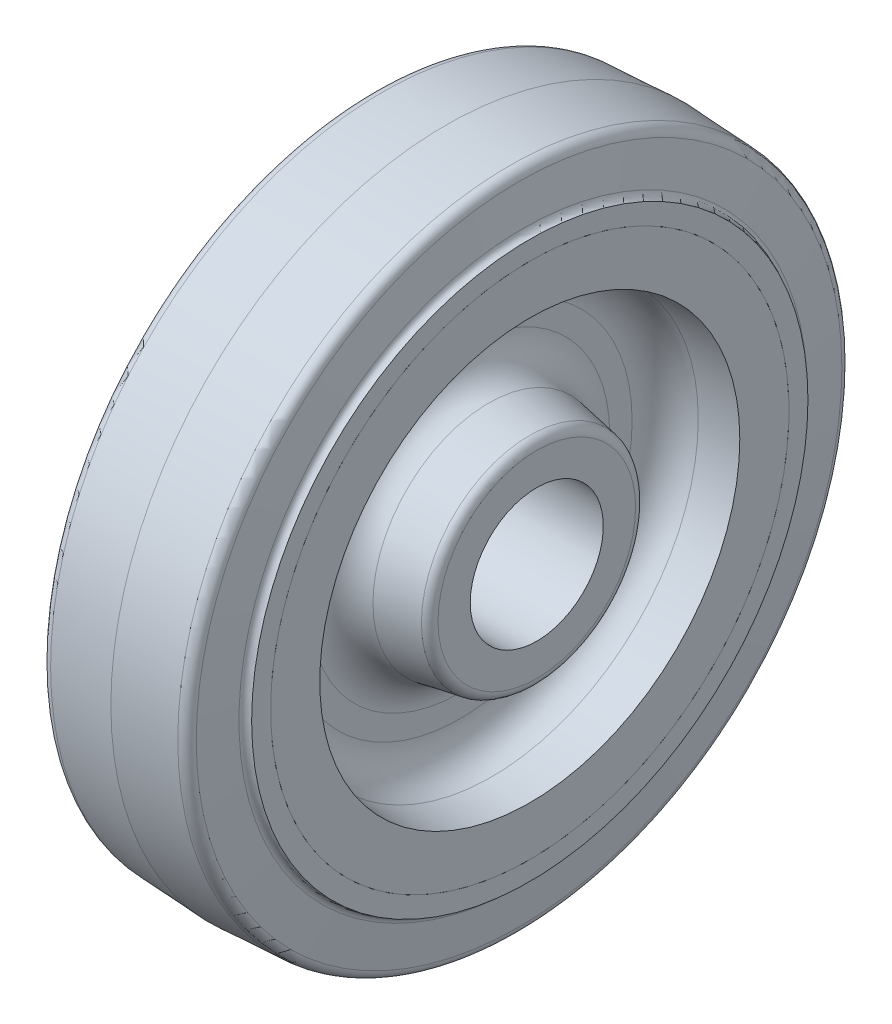
ISO-10303-21;
HEADER;
FILE_DESCRIPTION(('STEP AP214'),'2;1');
FILE_NAME('part.step','',(''),(''),'','','');
FILE_SCHEMA(('AUTOMOTIVE_DESIGN { 1 0 10303 214 1 1 1 1 }'));
ENDSEC;
DATA;
#1=APPLICATION_CONTEXT('core data for automotive mechanical design processes');
#2=APPLICATION_PROTOCOL_DEFINITION('international standard','automotive_design',2000,#1);
#3=PRODUCT_CONTEXT('',#1,'mechanical');
#4=PRODUCT('Part','Part','',(#3));
#5=PRODUCT_RELATED_PRODUCT_CATEGORY('part','',(#4));
#6=PRODUCT_DEFINITION_FORMATION('','',#4);
#7=PRODUCT_DEFINITION_CONTEXT('part definition',#1,'design');
#8=PRODUCT_DEFINITION('design','',#6,#7);
#9=PRODUCT_DEFINITION_SHAPE('','',#8);
#10=(LENGTH_UNIT() NAMED_UNIT(*) SI_UNIT(.MILLI.,.METRE.));
#11=(NAMED_UNIT(*) PLANE_ANGLE_UNIT() SI_UNIT($,.RADIAN.));
#12=(NAMED_UNIT(*) SI_UNIT($,.STERADIAN.) SOLID_ANGLE_UNIT());
#13=UNCERTAINTY_MEASURE_WITH_UNIT(LENGTH_MEASURE(1.E-05),#10,'distance_accuracy_value','');
#14=(GEOMETRIC_REPRESENTATION_CONTEXT(3) GLOBAL_UNCERTAINTY_ASSIGNED_CONTEXT((#13)) GLOBAL_UNIT_ASSIGNED_CONTEXT((#10,
#11,#12)) REPRESENTATION_CONTEXT('',''));
#15=CARTESIAN_POINT('',(0.,0.,0.));
#16=DIRECTION('',(0.,0.,1.));
#17=DIRECTION('',(1.,0.,0.));
#18=AXIS2_PLACEMENT_3D('',#15,#16,#17);
#19=CARTESIAN_POINT('',(0.,0.,0.));
#20=DIRECTION('',(-1.,0.,0.));
#21=DIRECTION('',(0.,0.,1.));
#22=AXIS2_PLACEMENT_3D('',#19,#20,#21);
#23=CONICAL_SURFACE('',#22,76.2,0.0523598775598228);
#24=CARTESIAN_POINT('',(14.4568836007253,0.,0.));
#25=DIRECTION('',(1.,0.,0.));
#26=DIRECTION('',(0.,0.,-1.));
#27=AXIS2_PLACEMENT_3D('',#24,#25,#26);
#28=CIRCLE('',#27,75.4423468351327);
#29=CARTESIAN_POINT('',(14.4568836007253,0.,-75.4423468351327));
#30=VERTEX_POINT('',#29);
#31=EDGE_CURVE('P0_E84',#30,#30,#28,.T.);
#32=ORIENTED_EDGE('',*,*,#31,.F.);
#33=EDGE_LOOP('',(#32));
#34=FACE_BOUND('',#33,.T.);
#35=CARTESIAN_POINT('',(0.,0.,0.));
#36=DIRECTION('',(1.,0.,0.));
#37=DIRECTION('',(0.,0.,-1.));
#38=AXIS2_PLACEMENT_3D('',#35,#36,#37);
#39=CIRCLE('',#38,76.2);
#40=CARTESIAN_POINT('',(0.,0.,-76.2));
#41=VERTEX_POINT('',#40);
#42=EDGE_CURVE('P0_E29',#41,#41,#39,.F.);
#43=ORIENTED_EDGE('',*,*,#42,.F.);
#44=EDGE_LOOP('',(#43));
#45=FACE_BOUND('',#44,.T.);
#46=ADVANCED_FACE('P0_F14',(#34,#45),#23,.T.);
#47=CARTESIAN_POINT('',(0.,0.,0.));
#48=DIRECTION('',(1.,0.,0.));
#49=DIRECTION('',(0.,0.,-1.));
#50=AXIS2_PLACEMENT_3D('',#47,#48,#49);
#51=CONICAL_SURFACE('',#50,76.2,0.0523598775598227);
#52=CARTESIAN_POINT('',(-14.4568836007253,0.,0.));
#53=DIRECTION('',(1.,0.,0.));
#54=DIRECTION('',(0.,0.,-1.));
#55=AXIS2_PLACEMENT_3D('',#52,#53,#54);
#56=CIRCLE('',#55,75.4423468351327);
#57=CARTESIAN_POINT('',(-14.4568836007253,0.,-75.4423468351327));
#58=VERTEX_POINT('',#57);
#59=EDGE_CURVE('P0_E82',#58,#58,#56,.F.);
#60=ORIENTED_EDGE('',*,*,#59,.F.);
#61=EDGE_LOOP('',(#60));
#62=FACE_BOUND('',#61,.T.);
#63=ORIENTED_EDGE('',*,*,#42,.T.);
#64=EDGE_LOOP('',(#63));
#65=FACE_BOUND('',#64,.T.);
#66=ADVANCED_FACE('P0_F75',(#62,#65),#51,.T.);
#67=CARTESIAN_POINT('',(14.3372436047539,0.,0.));
#68=DIRECTION('',(1.,0.,0.));
#69=DIRECTION('',(0.,0.,-1.));
#70=AXIS2_PLACEMENT_3D('',#67,#68,#69);
#71=TOROIDAL_SURFACE('',#70,73.1594797186837,2.286);
#72=ORIENTED_EDGE('',*,*,#31,.T.);
#73=EDGE_LOOP('',(#72));
#74=FACE_BOUND('',#73,.T.);
#75=CARTESIAN_POINT('',(16.6107206575658,0.,0.));
#76=DIRECTION('',(-1.,0.,0.));
#77=DIRECTION('',(0.,0.,1.));
#78=AXIS2_PLACEMENT_3D('',#75,#76,#77);
#79=CIRCLE('',#78,73.3984317857136);
#80=CARTESIAN_POINT('',(16.6107206575658,0.,73.3984317857136));
#81=VERTEX_POINT('',#80);
#82=EDGE_CURVE('P0_E79',#81,#81,#79,.F.);
#83=ORIENTED_EDGE('',*,*,#82,.F.);
#84=EDGE_LOOP('',(#83));
#85=FACE_BOUND('',#84,.T.);
#86=ADVANCED_FACE('P0_F71',(#74,#85),#71,.T.);
#87=CARTESIAN_POINT('',(-14.3372436047539,0.,0.));
#88=DIRECTION('',(1.,0.,0.));
#89=DIRECTION('',(0.,0.,-1.));
#90=AXIS2_PLACEMENT_3D('',#87,#88,#89);
#91=TOROIDAL_SURFACE('',#90,73.1594797186837,2.286);
#92=CARTESIAN_POINT('',(-16.6107206575658,0.,0.));
#93=DIRECTION('',(1.,0.,0.));
#94=DIRECTION('',(0.,0.,-1.));
#95=AXIS2_PLACEMENT_3D('',#92,#93,#94);
#96=CIRCLE('',#95,73.3984317857136);
#97=CARTESIAN_POINT('',(-16.6107206575658,0.,-73.3984317857136));
#98=VERTEX_POINT('',#97);
#99=EDGE_CURVE('P0_E56',#98,#98,#96,.F.);
#100=ORIENTED_EDGE('',*,*,#99,.F.);
#101=EDGE_LOOP('',(#100));
#102=FACE_BOUND('',#101,.T.);
#103=ORIENTED_EDGE('',*,*,#59,.T.);
#104=EDGE_LOOP('',(#103));
#105=FACE_BOUND('',#104,.T.);
#106=ADVANCED_FACE('P0_F66',(#102,#105),#91,.T.);
#107=CARTESIAN_POINT('',(16.6107206575658,0.,0.));
#108=DIRECTION('',(-1.,0.,0.));
#109=DIRECTION('',(0.,0.,1.));
#110=AXIS2_PLACEMENT_3D('',#107,#108,#109);
#111=CONICAL_SURFACE('',#110,73.3984317857136,1.46607657167524);
#112=CARTESIAN_POINT('',(17.5343486314588,0.,0.));
#113=DIRECTION('',(1.,0.,0.));
#114=DIRECTION('',(0.,0.,-1.));
#115=AXIS2_PLACEMENT_3D('',#112,#113,#114);
#116=CIRCLE('',#115,64.6106986219801);
#117=CARTESIAN_POINT('',(17.5343486314588,0.,-64.6106986219801));
#118=VERTEX_POINT('',#117);
#119=EDGE_CURVE('P0_E51',#118,#118,#116,.F.);
#120=ORIENTED_EDGE('',*,*,#119,.T.);
#121=EDGE_LOOP('',(#120));
#122=FACE_BOUND('',#121,.T.);
#123=ORIENTED_EDGE('',*,*,#82,.T.);
#124=EDGE_LOOP('',(#123));
#125=FACE_BOUND('',#124,.T.);
#126=ADVANCED_FACE('P0_F70',(#122,#125),#111,.T.);
#127=CARTESIAN_POINT('',(-16.6107206575658,0.,0.));
#128=DIRECTION('',(1.,0.,0.));
#129=DIRECTION('',(0.,0.,-1.));
#130=AXIS2_PLACEMENT_3D('',#127,#128,#129);
#131=CONICAL_SURFACE('',#130,73.3984317857136,1.46607657167524);
#132=CARTESIAN_POINT('',(-17.5343486314587,0.,0.));
#133=DIRECTION('',(1.,0.,0.));
#134=DIRECTION('',(0.,0.,-1.));
#135=AXIS2_PLACEMENT_3D('',#132,#133,#134);
#136=CIRCLE('',#135,64.6106986219801);
#137=CARTESIAN_POINT('',(-17.5343486314587,0.,-64.6106986219801));
#138=VERTEX_POINT('',#137);
#139=EDGE_CURVE('P0_E47',#138,#138,#136,.T.);
#140=ORIENTED_EDGE('',*,*,#139,.T.);
#141=EDGE_LOOP('',(#140));
#142=FACE_BOUND('',#141,.T.);
#143=ORIENTED_EDGE('',*,*,#99,.T.);
#144=EDGE_LOOP('',(#143));
#145=FACE_BOUND('',#144,.T.);
#146=ADVANCED_FACE('P0_F137',(#142,#145),#131,.T.);
#147=CARTESIAN_POINT('',(19.05,0.,0.));
#148=DIRECTION('',(1.,0.,0.));
#149=DIRECTION('',(0.,0.,-1.));
#150=AXIS2_PLACEMENT_3D('',#147,#148,#149);
#151=TOROIDAL_SURFACE('',#150,64.77,1.524);
#152=ORIENTED_EDGE('',*,*,#119,.F.);
#153=EDGE_LOOP('',(#152));
#154=FACE_BOUND('',#153,.T.);
#155=CARTESIAN_POINT('',(19.05,0.,0.));
#156=DIRECTION('',(1.,0.,0.));
#157=DIRECTION('',(0.,0.,-1.));
#158=AXIS2_PLACEMENT_3D('',#155,#156,#157);
#159=CIRCLE('',#158,63.246);
#160=CARTESIAN_POINT('',(19.05,0.,-63.246));
#161=VERTEX_POINT('',#160);
#162=EDGE_CURVE('P0_E17',#161,#161,#159,.T.);
#163=ORIENTED_EDGE('',*,*,#162,.F.);
#164=EDGE_LOOP('',(#163));
#165=FACE_BOUND('',#164,.T.);
#166=ADVANCED_FACE('P0_F133',(#154,#165),#151,.F.);
#167=CARTESIAN_POINT('',(-19.05,0.,0.));
#168=DIRECTION('',(1.,0.,0.));
#169=DIRECTION('',(0.,0.,-1.));
#170=AXIS2_PLACEMENT_3D('',#167,#168,#169);
#171=TOROIDAL_SURFACE('',#170,64.77,1.524);
#172=CARTESIAN_POINT('',(-19.05,0.,0.));
#173=DIRECTION('',(1.,0.,0.));
#174=DIRECTION('',(0.,0.,-1.));
#175=AXIS2_PLACEMENT_3D('',#172,#173,#174);
#176=CIRCLE('',#175,63.246);
#177=CARTESIAN_POINT('',(-19.05,0.,-63.246));
#178=VERTEX_POINT('',#177);
#179=EDGE_CURVE('P0_E42',#178,#178,#176,.F.);
#180=ORIENTED_EDGE('',*,*,#179,.F.);
#181=EDGE_LOOP('',(#180));
#182=FACE_BOUND('',#181,.T.);
#183=ORIENTED_EDGE('',*,*,#139,.F.);
#184=EDGE_LOOP('',(#183));
#185=FACE_BOUND('',#184,.T.);
#186=ADVANCED_FACE('P0_F129',(#182,#185),#171,.F.);
#187=CARTESIAN_POINT('',(19.05,63.246,0.));
#188=DIRECTION('',(1.,0.,0.));
#189=DIRECTION('',(0.,0.,-1.));
#190=AXIS2_PLACEMENT_3D('',#187,#188,#189);
#191=PLANE('',#190);
#192=CARTESIAN_POINT('',(19.05,0.,0.));
#193=DIRECTION('',(1.,0.,0.));
#194=DIRECTION('',(0.,0.,-1.));
#195=AXIS2_PLACEMENT_3D('',#192,#193,#194);
#196=CIRCLE('',#195,58.928);
#197=CARTESIAN_POINT('',(19.05,0.,-58.928));
#198=VERTEX_POINT('',#197);
#199=EDGE_CURVE('P0_E40',#198,#198,#196,.F.);
#200=ORIENTED_EDGE('',*,*,#199,.T.);
#201=EDGE_LOOP('',(#200));
#202=FACE_BOUND('',#201,.T.);
#203=ORIENTED_EDGE('',*,*,#162,.T.);
#204=EDGE_LOOP('',(#203));
#205=FACE_BOUND('',#204,.T.);
#206=ADVANCED_FACE('P0_F126',(#202,#205),#191,.T.);
#207=CARTESIAN_POINT('',(-19.05,58.928,0.));
#208=DIRECTION('',(-1.,0.,0.));
#209=DIRECTION('',(0.,0.,1.));
#210=AXIS2_PLACEMENT_3D('',#207,#208,#209);
#211=PLANE('',#210);
#212=ORIENTED_EDGE('',*,*,#179,.T.);
#213=EDGE_LOOP('',(#212));
#214=FACE_BOUND('',#213,.T.);
#215=CARTESIAN_POINT('',(-19.05,0.,0.));
#216=DIRECTION('',(1.,0.,0.));
#217=DIRECTION('',(0.,0.,-1.));
#218=AXIS2_PLACEMENT_3D('',#215,#216,#217);
#219=CIRCLE('',#218,58.928);
#220=CARTESIAN_POINT('',(-19.05,0.,-58.928));
#221=VERTEX_POINT('',#220);
#222=EDGE_CURVE('P0_E37',#221,#221,#219,.T.);
#223=ORIENTED_EDGE('',*,*,#222,.T.);
#224=EDGE_LOOP('',(#223));
#225=FACE_BOUND('',#224,.T.);
#226=ADVANCED_FACE('P0_F122',(#214,#225),#211,.T.);
#227=CARTESIAN_POINT('',(0.,0.,0.));
#228=DIRECTION('',(1.,0.,0.));
#229=DIRECTION('',(0.,0.,-1.));
#230=AXIS2_PLACEMENT_3D('',#227,#228,#229);
#231=CYLINDRICAL_SURFACE('',#230,58.928);
#232=ORIENTED_EDGE('',*,*,#199,.F.);
#233=EDGE_LOOP('',(#232));
#234=FACE_BOUND('',#233,.T.);
#235=CARTESIAN_POINT('',(12.7,0.,0.));
#236=DIRECTION('',(1.,0.,0.));
#237=DIRECTION('',(0.,0.,-1.));
#238=AXIS2_PLACEMENT_3D('',#235,#236,#237);
#239=CIRCLE('',#238,58.928);
#240=CARTESIAN_POINT('',(12.7,0.,-58.928));
#241=VERTEX_POINT('',#240);
#242=EDGE_CURVE('P0_E34',#241,#241,#239,.T.);
#243=ORIENTED_EDGE('',*,*,#242,.F.);
#244=EDGE_LOOP('',(#243));
#245=FACE_BOUND('',#244,.T.);
#246=ADVANCED_FACE('P0_F118',(#234,#245),#231,.F.);
#247=CARTESIAN_POINT('',(0.,0.,0.));
#248=DIRECTION('',(1.,0.,0.));
#249=DIRECTION('',(0.,0.,-1.));
#250=AXIS2_PLACEMENT_3D('',#247,#248,#249);
#251=CYLINDRICAL_SURFACE('',#250,58.928);
#252=CARTESIAN_POINT('',(-12.7,0.,0.));
#253=DIRECTION('',(1.,0.,0.));
#254=DIRECTION('',(0.,0.,-1.));
#255=AXIS2_PLACEMENT_3D('',#252,#253,#254);
#256=CIRCLE('',#255,58.928);
#257=CARTESIAN_POINT('',(-12.7,0.,-58.928));
#258=VERTEX_POINT('',#257);
#259=EDGE_CURVE('P0_E26',#258,#258,#256,.F.);
#260=ORIENTED_EDGE('',*,*,#259,.F.);
#261=EDGE_LOOP('',(#260));
#262=FACE_BOUND('',#261,.T.);
#263=ORIENTED_EDGE('',*,*,#222,.F.);
#264=EDGE_LOOP('',(#263));
#265=FACE_BOUND('',#264,.T.);
#266=ADVANCED_FACE('P0_F114',(#262,#265),#251,.F.);
#267=CARTESIAN_POINT('',(12.7,58.928,0.));
#268=DIRECTION('',(-1.,0.,0.));
#269=DIRECTION('',(0.,0.,1.));
#270=AXIS2_PLACEMENT_3D('',#267,#268,#269);
#271=PLANE('',#270);
#272=CARTESIAN_POINT('',(12.7,0.,0.));
#273=DIRECTION('',(1.,0.,0.));
#274=DIRECTION('',(0.,0.,-1.));
#275=AXIS2_PLACEMENT_3D('',#272,#273,#274);
#276=CIRCLE('',#275,66.548);
#277=CARTESIAN_POINT('',(12.7,0.,-66.548));
#278=VERTEX_POINT('',#277);
#279=EDGE_CURVE('P0_E21',#278,#278,#276,.F.);
#280=ORIENTED_EDGE('',*,*,#279,.T.);
#281=EDGE_LOOP('',(#280));
#282=FACE_BOUND('',#281,.T.);
#283=ORIENTED_EDGE('',*,*,#242,.T.);
#284=EDGE_LOOP('',(#283));
#285=FACE_BOUND('',#284,.T.);
#286=ADVANCED_FACE('P0_F106',(#282,#285),#271,.T.);
#287=CARTESIAN_POINT('',(-12.7,66.548,0.));
#288=DIRECTION('',(1.,0.,0.));
#289=DIRECTION('',(0.,0.,-1.));
#290=AXIS2_PLACEMENT_3D('',#287,#288,#289);
#291=PLANE('',#290);
#292=ORIENTED_EDGE('',*,*,#259,.T.);
#293=EDGE_LOOP('',(#292));
#294=FACE_BOUND('',#293,.T.);
#295=CARTESIAN_POINT('',(-12.7,0.,0.));
#296=DIRECTION('',(1.,0.,0.));
#297=DIRECTION('',(0.,0.,-1.));
#298=AXIS2_PLACEMENT_3D('',#295,#296,#297);
#299=CIRCLE('',#298,66.548);
#300=CARTESIAN_POINT('',(-12.7,0.,-66.548));
#301=VERTEX_POINT('',#300);
#302=EDGE_CURVE('P0_E10',#301,#301,#299,.T.);
#303=ORIENTED_EDGE('',*,*,#302,.T.);
#304=EDGE_LOOP('',(#303));
#305=FACE_BOUND('',#304,.T.);
#306=ADVANCED_FACE('P0_F100',(#294,#305),#291,.T.);
#307=CARTESIAN_POINT('',(0.,0.,0.));
#308=DIRECTION('',(1.,0.,0.));
#309=DIRECTION('',(0.,0.,-1.));
#310=AXIS2_PLACEMENT_3D('',#307,#308,#309);
#311=CYLINDRICAL_SURFACE('',#310,66.548);
#312=ORIENTED_EDGE('',*,*,#279,.F.);
#313=EDGE_LOOP('',(#312));
#314=FACE_BOUND('',#313,.T.);
#315=ORIENTED_EDGE('',*,*,#302,.F.);
#316=EDGE_LOOP('',(#315));
#317=FACE_BOUND('',#316,.T.);
#318=ADVANCED_FACE('P0_F98',(#314,#317),#311,.F.);
#319=CLOSED_SHELL('',(#46,#66,#86,#106,#126,#146,#166,#186,#206,#226,#246,#266,#286,#306,#318));
#320=MANIFOLD_SOLID_BREP('P0_B1',#319);
#321=CARTESIAN_POINT('',(-72.5714285714286,0.,0.));
#322=DIRECTION('',(-1.,0.,0.));
#323=DIRECTION('',(0.,0.,1.));
#324=AXIS2_PLACEMENT_3D('',#321,#322,#323);
#325=CYLINDRICAL_SURFACE('',#324,15.1257);
#326=CARTESIAN_POINT('',(20.6375,0.,0.));
#327=DIRECTION('',(-1.,0.,0.));
#328=DIRECTION('',(0.,0.,1.));
#329=AXIS2_PLACEMENT_3D('',#326,#327,#328);
#330=CIRCLE('',#329,15.1257);
#331=CARTESIAN_POINT('',(20.6375,0.,15.1257));
#332=VERTEX_POINT('',#331);
#333=EDGE_CURVE('P1_E404',#332,#332,#330,.F.);
#334=ORIENTED_EDGE('',*,*,#333,.T.);
#335=EDGE_LOOP('',(#334));
#336=FACE_BOUND('',#335,.T.);
#337=CARTESIAN_POINT('',(-20.6375,0.,0.));
#338=DIRECTION('',(-1.,0.,0.));
#339=DIRECTION('',(0.,0.,1.));
#340=AXIS2_PLACEMENT_3D('',#337,#338,#339);
#341=CIRCLE('',#340,15.1257);
#342=CARTESIAN_POINT('',(-20.6375,0.,15.1257));
#343=VERTEX_POINT('',#342);
#344=EDGE_CURVE('P1_E75',#343,#343,#341,.T.);
#345=ORIENTED_EDGE('',*,*,#344,.T.);
#346=EDGE_LOOP('',(#345));
#347=FACE_BOUND('',#346,.T.);
#348=ADVANCED_FACE('P1_F16',(#336,#347),#325,.F.);
#349=CARTESIAN_POINT('',(20.6375,15.1257,0.));
#350=DIRECTION('',(-1.,0.,0.));
#351=DIRECTION('',(0.,0.,1.));
#352=AXIS2_PLACEMENT_3D('',#349,#350,#351);
#353=PLANE('',#352);
#354=ORIENTED_EDGE('',*,*,#333,.F.);
#355=EDGE_LOOP('',(#354));
#356=FACE_BOUND('',#355,.T.);
#357=CARTESIAN_POINT('',(20.6375,0.,0.));
#358=DIRECTION('',(-1.,0.,0.));
#359=DIRECTION('',(0.,0.,-1.));
#360=AXIS2_PLACEMENT_3D('',#357,#358,#359);
#361=CIRCLE('',#360,22.4613296643727);
#362=CARTESIAN_POINT('',(20.6375,0.,-22.4613296643727));
#363=VERTEX_POINT('',#362);
#364=CARTESIAN_POINT('',(20.6375,0.,22.4613296643727));
#365=VERTEX_POINT('',#364);
#366=EDGE_CURVE('P1_E73',#363,#365,#361,.T.);
#367=ORIENTED_EDGE('',*,*,#366,.F.);
#368=CARTESIAN_POINT('',(20.6375,0.,0.));
#369=DIRECTION('',(-1.,0.,0.));
#370=DIRECTION('',(0.,0.,1.));
#371=AXIS2_PLACEMENT_3D('',#368,#369,#370);
#372=CIRCLE('',#371,22.4613296643727);
#373=EDGE_CURVE('P1_E68',#365,#363,#372,.T.);
#374=ORIENTED_EDGE('',*,*,#373,.F.);
#375=EDGE_LOOP('',(#367,#374));
#376=FACE_BOUND('',#375,.T.);
#377=ADVANCED_FACE('P1_F72',(#356,#376),#353,.F.);
#378=CARTESIAN_POINT('',(-20.6375,15.1257,0.));
#379=DIRECTION('',(1.,0.,0.));
#380=DIRECTION('',(0.,0.,-1.));
#381=AXIS2_PLACEMENT_3D('',#378,#379,#380);
#382=PLANE('',#381);
#383=ORIENTED_EDGE('',*,*,#344,.F.);
#384=EDGE_LOOP('',(#383));
#385=FACE_BOUND('',#384,.T.);
#386=CARTESIAN_POINT('',(-20.6375,0.,0.));
#387=DIRECTION('',(1.,0.,0.));
#388=DIRECTION('',(0.,0.,1.));
#389=AXIS2_PLACEMENT_3D('',#386,#387,#388);
#390=CIRCLE('',#389,22.4613296643727);
#391=CARTESIAN_POINT('',(-20.6375,0.,22.4613296643727));
#392=VERTEX_POINT('',#391);
#393=CARTESIAN_POINT('',(-20.6375,0.,-22.4613296643727));
#394=VERTEX_POINT('',#393);
#395=EDGE_CURVE('P1_E113',#392,#394,#390,.T.);
#396=ORIENTED_EDGE('',*,*,#395,.F.);
#397=CARTESIAN_POINT('',(-20.6375,0.,0.));
#398=DIRECTION('',(1.,0.,0.));
#399=DIRECTION('',(0.,0.,-1.));
#400=AXIS2_PLACEMENT_3D('',#397,#398,#399);
#401=CIRCLE('',#400,22.4613296643727);
#402=EDGE_CURVE('P1_E80',#394,#392,#401,.T.);
#403=ORIENTED_EDGE('',*,*,#402,.F.);
#404=EDGE_LOOP('',(#396,#403));
#405=FACE_BOUND('',#404,.T.);
#406=ADVANCED_FACE('P1_F98',(#385,#405),#382,.F.);
#407=CARTESIAN_POINT('',(18.3515,0.,0.));
#408=DIRECTION('',(1.,0.,0.));
#409=DIRECTION('',(0.,0.,-1.));
#410=AXIS2_PLACEMENT_3D('',#407,#408,#409);
#411=TOROIDAL_SURFACE('',#410,22.4613296643727,2.286);
#412=CARTESIAN_POINT('',(19.05,0.,0.));
#413=DIRECTION('',(-1.,0.,0.));
#414=DIRECTION('',(0.,0.,1.));
#415=AXIS2_PLACEMENT_3D('',#412,#413,#414);
#416=CIRCLE('',#415,24.638);
#417=CARTESIAN_POINT('',(19.05,0.,24.638));
#418=VERTEX_POINT('',#417);
#419=EDGE_CURVE('P1_E108',#418,#418,#416,.T.);
#420=ORIENTED_EDGE('',*,*,#419,.F.);
#421=EDGE_LOOP('',(#420));
#422=FACE_BOUND('',#421,.T.);
#423=ORIENTED_EDGE('',*,*,#366,.T.);
#424=ORIENTED_EDGE('',*,*,#373,.T.);
#425=EDGE_LOOP('',(#423,#424));
#426=FACE_BOUND('',#425,.T.);
#427=ADVANCED_FACE('P1_F79',(#422,#426),#411,.T.);
#428=CARTESIAN_POINT('',(-18.3515,0.,0.));
#429=DIRECTION('',(-1.,0.,0.));
#430=DIRECTION('',(0.,0.,1.));
#431=AXIS2_PLACEMENT_3D('',#428,#429,#430);
#432=TOROIDAL_SURFACE('',#431,22.4613296643727,2.286);
#433=CARTESIAN_POINT('',(-19.05,0.,0.));
#434=DIRECTION('',(1.,0.,0.));
#435=DIRECTION('',(0.,0.,-1.));
#436=AXIS2_PLACEMENT_3D('',#433,#434,#435);
#437=CIRCLE('',#436,24.638);
#438=CARTESIAN_POINT('',(-19.05,0.,-24.638));
#439=VERTEX_POINT('',#438);
#440=EDGE_CURVE('P1_E374',#439,#439,#437,.T.);
#441=ORIENTED_EDGE('',*,*,#440,.F.);
#442=EDGE_LOOP('',(#441));
#443=FACE_BOUND('',#442,.T.);
#444=ORIENTED_EDGE('',*,*,#395,.T.);
#445=ORIENTED_EDGE('',*,*,#402,.T.);
#446=EDGE_LOOP('',(#444,#445));
#447=FACE_BOUND('',#446,.T.);
#448=ADVANCED_FACE('P1_F97',(#443,#447),#432,.T.);
#449=CARTESIAN_POINT('',(9.68169424905057,0.,0.));
#450=DIRECTION('',(-1.,0.,0.));
#451=DIRECTION('',(0.,0.,1.));
#452=AXIS2_PLACEMENT_3D('',#449,#450,#451);
#453=CONICAL_SURFACE('',#452,26.2898850674187,0.174532925199434);
#454=ORIENTED_EDGE('',*,*,#419,.T.);
#455=EDGE_LOOP('',(#454));
#456=FACE_BOUND('',#455,.T.);
#457=CARTESIAN_POINT('',(9.68169424905058,0.,0.));
#458=DIRECTION('',(-1.,0.,0.));
#459=DIRECTION('',(0.,0.,1.));
#460=AXIS2_PLACEMENT_3D('',#457,#458,#459);
#461=CIRCLE('',#460,26.2898850674187);
#462=CARTESIAN_POINT('',(9.68169424905058,0.,26.2898850674187));
#463=VERTEX_POINT('',#462);
#464=EDGE_CURVE('P1_E378',#463,#463,#461,.F.);
#465=ORIENTED_EDGE('',*,*,#464,.T.);
#466=EDGE_LOOP('',(#465));
#467=FACE_BOUND('',#466,.T.);
#468=ADVANCED_FACE('P1_F556',(#456,#467),#453,.T.);
#469=CARTESIAN_POINT('',(-9.68169424905058,0.,0.));
#470=DIRECTION('',(1.,0.,0.));
#471=DIRECTION('',(0.,0.,-1.));
#472=AXIS2_PLACEMENT_3D('',#469,#470,#471);
#473=CONICAL_SURFACE('',#472,26.2898850674187,0.174532925199433);
#474=ORIENTED_EDGE('',*,*,#440,.T.);
#475=EDGE_LOOP('',(#474));
#476=FACE_BOUND('',#475,.T.);
#477=CARTESIAN_POINT('',(-9.68169424905058,0.,0.));
#478=DIRECTION('',(-1.,0.,0.));
#479=DIRECTION('',(0.,0.,1.));
#480=AXIS2_PLACEMENT_3D('',#477,#478,#479);
#481=CIRCLE('',#480,26.2898850674187);
#482=CARTESIAN_POINT('',(-9.68169424905058,0.,26.2898850674187));
#483=VERTEX_POINT('',#482);
#484=EDGE_CURVE('P1_E383',#483,#483,#481,.T.);
#485=ORIENTED_EDGE('',*,*,#484,.T.);
#486=EDGE_LOOP('',(#485));
#487=FACE_BOUND('',#486,.T.);
#488=ADVANCED_FACE('P1_F547',(#476,#487),#473,.T.);
#489=CARTESIAN_POINT('',(11.049,0.,0.));
#490=DIRECTION('',(-1.,0.,0.));
#491=DIRECTION('',(0.,0.,1.));
#492=AXIS2_PLACEMENT_3D('',#489,#490,#491);
#493=TOROIDAL_SURFACE('',#492,34.0442613146368,7.874);
#494=ORIENTED_EDGE('',*,*,#464,.F.);
#495=EDGE_LOOP('',(#494));
#496=FACE_BOUND('',#495,.T.);
#497=CARTESIAN_POINT('',(3.175,0.,0.));
#498=DIRECTION('',(1.,0.,0.));
#499=DIRECTION('',(0.,0.,1.));
#500=AXIS2_PLACEMENT_3D('',#497,#498,#499);
#501=CIRCLE('',#500,34.0442613146368);
#502=CARTESIAN_POINT('',(3.175,0.,-34.0442613146368));
#503=VERTEX_POINT('',#502);
#504=CARTESIAN_POINT('',(3.175,0.,34.0442613146368));
#505=VERTEX_POINT('',#504);
#506=EDGE_CURVE('P1_E287',#503,#505,#501,.F.);
#507=ORIENTED_EDGE('',*,*,#506,.F.);
#508=CARTESIAN_POINT('',(3.175,0.,0.));
#509=DIRECTION('',(1.,0.,0.));
#510=DIRECTION('',(0.,0.,-1.));
#511=AXIS2_PLACEMENT_3D('',#508,#509,#510);
#512=CIRCLE('',#511,34.0442613146368);
#513=EDGE_CURVE('P1_E277',#505,#503,#512,.F.);
#514=ORIENTED_EDGE('',*,*,#513,.F.);
#515=EDGE_LOOP('',(#507,#514));
#516=FACE_BOUND('',#515,.T.);
#517=ADVANCED_FACE('P1_F336',(#496,#516),#493,.F.);
#518=CARTESIAN_POINT('',(-11.049,0.,0.));
#519=DIRECTION('',(-1.,0.,0.));
#520=DIRECTION('',(0.,0.,1.));
#521=AXIS2_PLACEMENT_3D('',#518,#519,#520);
#522=TOROIDAL_SURFACE('',#521,34.0442613146368,7.874);
#523=CARTESIAN_POINT('',(-3.175,0.,0.));
#524=DIRECTION('',(-1.,0.,0.));
#525=DIRECTION('',(0.,0.,-1.));
#526=AXIS2_PLACEMENT_3D('',#523,#524,#525);
#527=CIRCLE('',#526,34.0442613146368);
#528=CARTESIAN_POINT('',(-3.175,0.,34.0442613146368));
#529=VERTEX_POINT('',#528);
#530=CARTESIAN_POINT('',(-3.175,0.,-34.0442613146368));
#531=VERTEX_POINT('',#530);
#532=EDGE_CURVE('P1_E256',#529,#531,#527,.F.);
#533=ORIENTED_EDGE('',*,*,#532,.F.);
#534=CARTESIAN_POINT('',(-3.175,0.,0.));
#535=DIRECTION('',(-1.,0.,0.));
#536=DIRECTION('',(0.,0.,1.));
#537=AXIS2_PLACEMENT_3D('',#534,#535,#536);
#538=CIRCLE('',#537,34.0442613146368);
#539=EDGE_CURVE('P1_E398',#531,#529,#538,.F.);
#540=ORIENTED_EDGE('',*,*,#539,.F.);
#541=EDGE_LOOP('',(#533,#540));
#542=FACE_BOUND('',#541,.T.);
#543=ORIENTED_EDGE('',*,*,#484,.F.);
#544=EDGE_LOOP('',(#543));
#545=FACE_BOUND('',#544,.T.);
#546=ADVANCED_FACE('P1_F332',(#542,#545),#522,.F.);
#547=CARTESIAN_POINT('',(3.175,39.1479258023128,0.));
#548=DIRECTION('',(1.,0.,0.));
#549=DIRECTION('',(0.,0.,-1.));
#550=AXIS2_PLACEMENT_3D('',#547,#548,#549);
#551=PLANE('',#550);
#552=CARTESIAN_POINT('',(3.175,0.,0.));
#553=DIRECTION('',(-1.,0.,0.));
#554=DIRECTION('',(0.,0.,1.));
#555=AXIS2_PLACEMENT_3D('',#552,#553,#554);
#556=CIRCLE('',#555,39.1479258023128);
#557=CARTESIAN_POINT('',(3.175,0.,-39.1479258023128));
#558=VERTEX_POINT('',#557);
#559=CARTESIAN_POINT('',(3.175,0.,39.1479258023128));
#560=VERTEX_POINT('',#559);
#561=EDGE_CURVE('P1_E299',#558,#560,#556,.F.);
#562=ORIENTED_EDGE('',*,*,#561,.T.);
#563=CARTESIAN_POINT('',(3.175,0.,0.));
#564=DIRECTION('',(-1.,0.,0.));
#565=DIRECTION('',(0.,0.,-1.));
#566=AXIS2_PLACEMENT_3D('',#563,#564,#565);
#567=CIRCLE('',#566,39.1479258023128);
#568=EDGE_CURVE('P1_E310',#560,#558,#567,.F.);
#569=ORIENTED_EDGE('',*,*,#568,.T.);
#570=EDGE_LOOP('',(#562,#569));
#571=FACE_BOUND('',#570,.T.);
#572=ORIENTED_EDGE('',*,*,#513,.T.);
#573=ORIENTED_EDGE('',*,*,#506,.T.);
#574=EDGE_LOOP('',(#572,#573));
#575=FACE_BOUND('',#574,.T.);
#576=ADVANCED_FACE('P1_F234',(#571,#575),#551,.T.);
#577=CARTESIAN_POINT('',(-3.175,39.1479258023128,0.));
#578=DIRECTION('',(-1.,0.,0.));
#579=DIRECTION('',(0.,0.,1.));
#580=AXIS2_PLACEMENT_3D('',#577,#578,#579);
#581=PLANE('',#580);
#582=ORIENTED_EDGE('',*,*,#539,.T.);
#583=ORIENTED_EDGE('',*,*,#532,.T.);
#584=EDGE_LOOP('',(#582,#583));
#585=FACE_BOUND('',#584,.T.);
#586=CARTESIAN_POINT('',(-3.175,0.,0.));
#587=DIRECTION('',(1.,0.,0.));
#588=DIRECTION('',(0.,0.,-1.));
#589=AXIS2_PLACEMENT_3D('',#586,#587,#588);
#590=CIRCLE('',#589,39.1479258023128);
#591=CARTESIAN_POINT('',(-3.175,0.,39.1479258023128));
#592=VERTEX_POINT('',#591);
#593=CARTESIAN_POINT('',(-3.175,0.,-39.1479258023128));
#594=VERTEX_POINT('',#593);
#595=EDGE_CURVE('P1_E35',#592,#594,#590,.F.);
#596=ORIENTED_EDGE('',*,*,#595,.T.);
#597=CARTESIAN_POINT('',(-3.175,0.,0.));
#598=DIRECTION('',(1.,0.,0.));
#599=DIRECTION('',(0.,0.,1.));
#600=AXIS2_PLACEMENT_3D('',#597,#598,#599);
#601=CIRCLE('',#600,39.1479258023128);
#602=EDGE_CURVE('P1_E399',#594,#592,#601,.F.);
#603=ORIENTED_EDGE('',*,*,#602,.T.);
#604=EDGE_LOOP('',(#596,#603));
#605=FACE_BOUND('',#604,.T.);
#606=ADVANCED_FACE('P1_F225',(#585,#605),#581,.T.);
#607=CARTESIAN_POINT('',(11.049,0.,0.));
#608=DIRECTION('',(-1.,0.,0.));
#609=DIRECTION('',(0.,0.,1.));
#610=AXIS2_PLACEMENT_3D('',#607,#608,#609);
#611=TOROIDAL_SURFACE('',#610,39.1479258023128,7.874);
#612=ORIENTED_EDGE('',*,*,#568,.F.);
#613=ORIENTED_EDGE('',*,*,#561,.F.);
#614=EDGE_LOOP('',(#612,#613));
#615=FACE_BOUND('',#614,.T.);
#616=CARTESIAN_POINT('',(10.362735681605,0.,0.));
#617=DIRECTION('',(1.,0.,0.));
#618=DIRECTION('',(0.,0.,-1.));
#619=AXIS2_PLACEMENT_3D('',#616,#617,#618);
#620=CIRCLE('',#619,46.9919628550872);
#621=CARTESIAN_POINT('',(10.362735681605,0.,-46.9919628550872));
#622=VERTEX_POINT('',#621);
#623=EDGE_CURVE('P1_E218',#622,#622,#620,.T.);
#624=ORIENTED_EDGE('',*,*,#623,.T.);
#625=EDGE_LOOP('',(#624));
#626=FACE_BOUND('',#625,.T.);
#627=ADVANCED_FACE('P1_F206',(#615,#626),#611,.F.);
#628=CARTESIAN_POINT('',(-11.049,0.,0.));
#629=DIRECTION('',(-1.,0.,0.));
#630=DIRECTION('',(0.,0.,1.));
#631=AXIS2_PLACEMENT_3D('',#628,#629,#630);
#632=TOROIDAL_SURFACE('',#631,39.1479258023128,7.874);
#633=ORIENTED_EDGE('',*,*,#595,.F.);
#634=ORIENTED_EDGE('',*,*,#602,.F.);
#635=EDGE_LOOP('',(#633,#634));
#636=FACE_BOUND('',#635,.T.);
#637=CARTESIAN_POINT('',(-10.362735681605,0.,0.));
#638=DIRECTION('',(-1.,0.,0.));
#639=DIRECTION('',(0.,0.,1.));
#640=AXIS2_PLACEMENT_3D('',#637,#638,#639);
#641=CIRCLE('',#640,46.9919628550872);
#642=CARTESIAN_POINT('',(-10.362735681605,0.,46.9919628550872));
#643=VERTEX_POINT('',#642);
#644=EDGE_CURVE('P1_E215',#643,#643,#641,.T.);
#645=ORIENTED_EDGE('',*,*,#644,.T.);
#646=EDGE_LOOP('',(#645));
#647=FACE_BOUND('',#646,.T.);
#648=ADVANCED_FACE('P1_F200',(#636,#647),#632,.F.);
#649=CARTESIAN_POINT('',(19.05,0.,0.));
#650=DIRECTION('',(1.,0.,0.));
#651=DIRECTION('',(0.,0.,-1.));
#652=AXIS2_PLACEMENT_3D('',#649,#650,#651);
#653=CONICAL_SURFACE('',#652,47.752,0.0872664625997169);
#654=CARTESIAN_POINT('',(19.05,0.,0.));
#655=DIRECTION('',(1.,0.,0.));
#656=DIRECTION('',(0.,0.,-1.));
#657=AXIS2_PLACEMENT_3D('',#654,#655,#656);
#658=CIRCLE('',#657,47.752);
#659=CARTESIAN_POINT('',(19.05,0.,-47.752));
#660=VERTEX_POINT('',#659);
#661=EDGE_CURVE('P1_E662',#660,#660,#658,.T.);
#662=ORIENTED_EDGE('',*,*,#661,.T.);
#663=EDGE_LOOP('',(#662));
#664=FACE_BOUND('',#663,.T.);
#665=ORIENTED_EDGE('',*,*,#623,.F.);
#666=EDGE_LOOP('',(#665));
#667=FACE_BOUND('',#666,.T.);
#668=ADVANCED_FACE('P1_F196',(#664,#667),#653,.F.);
#669=CARTESIAN_POINT('',(-19.05,0.,0.));
#670=DIRECTION('',(-1.,0.,0.));
#671=DIRECTION('',(0.,0.,1.));
#672=AXIS2_PLACEMENT_3D('',#669,#670,#671);
#673=CONICAL_SURFACE('',#672,47.752,0.0872664625997161);
#674=ORIENTED_EDGE('',*,*,#644,.F.);
#675=EDGE_LOOP('',(#674));
#676=FACE_BOUND('',#675,.T.);
#677=CARTESIAN_POINT('',(-19.05,0.,0.));
#678=DIRECTION('',(-1.,0.,0.));
#679=DIRECTION('',(0.,0.,1.));
#680=AXIS2_PLACEMENT_3D('',#677,#678,#679);
#681=CIRCLE('',#680,47.752);
#682=CARTESIAN_POINT('',(-19.05,0.,47.752));
#683=VERTEX_POINT('',#682);
#684=EDGE_CURVE('P1_E665',#683,#683,#681,.T.);
#685=ORIENTED_EDGE('',*,*,#684,.T.);
#686=EDGE_LOOP('',(#685));
#687=FACE_BOUND('',#686,.T.);
#688=ADVANCED_FACE('P1_F192',(#676,#687),#673,.F.);
#689=CARTESIAN_POINT('',(19.05,58.928,0.));
#690=DIRECTION('',(-1.,0.,0.));
#691=DIRECTION('',(0.,0.,1.));
#692=AXIS2_PLACEMENT_3D('',#689,#690,#691);
#693=PLANE('',#692);
#694=ORIENTED_EDGE('',*,*,#661,.F.);
#695=EDGE_LOOP('',(#694));
#696=FACE_BOUND('',#695,.T.);
#697=CARTESIAN_POINT('',(19.05,0.,0.));
#698=DIRECTION('',(-1.,0.,0.));
#699=DIRECTION('',(0.,0.,1.));
#700=AXIS2_PLACEMENT_3D('',#697,#698,#699);
#701=CIRCLE('',#700,58.928);
#702=CARTESIAN_POINT('',(19.05,0.,58.928));
#703=VERTEX_POINT('',#702);
#704=EDGE_CURVE('P1_E668',#703,#703,#701,.T.);
#705=ORIENTED_EDGE('',*,*,#704,.F.);
#706=EDGE_LOOP('',(#705));
#707=FACE_BOUND('',#706,.T.);
#708=ADVANCED_FACE('P1_F188',(#696,#707),#693,.F.);
#709=CARTESIAN_POINT('',(-19.05,24.638,0.));
#710=DIRECTION('',(1.,0.,0.));
#711=DIRECTION('',(0.,0.,-1.));
#712=AXIS2_PLACEMENT_3D('',#709,#710,#711);
#713=PLANE('',#712);
#714=ORIENTED_EDGE('',*,*,#684,.F.);
#715=EDGE_LOOP('',(#714));
#716=FACE_BOUND('',#715,.T.);
#717=CARTESIAN_POINT('',(-19.05,0.,0.));
#718=DIRECTION('',(-1.,0.,0.));
#719=DIRECTION('',(0.,0.,1.));
#720=AXIS2_PLACEMENT_3D('',#717,#718,#719);
#721=CIRCLE('',#720,58.928);
#722=CARTESIAN_POINT('',(-19.05,0.,58.928));
#723=VERTEX_POINT('',#722);
#724=EDGE_CURVE('P1_E671',#723,#723,#721,.F.);
#725=ORIENTED_EDGE('',*,*,#724,.F.);
#726=EDGE_LOOP('',(#725));
#727=FACE_BOUND('',#726,.T.);
#728=ADVANCED_FACE('P1_F184',(#716,#727),#713,.F.);
#729=CARTESIAN_POINT('',(-72.5714285714286,0.,0.));
#730=DIRECTION('',(-1.,0.,0.));
#731=DIRECTION('',(0.,0.,1.));
#732=AXIS2_PLACEMENT_3D('',#729,#730,#731);
#733=CYLINDRICAL_SURFACE('',#732,58.928);
#734=CARTESIAN_POINT('',(12.7,0.,0.));
#735=DIRECTION('',(-1.,0.,0.));
#736=DIRECTION('',(0.,0.,1.));
#737=AXIS2_PLACEMENT_3D('',#734,#735,#736);
#738=CIRCLE('',#737,58.928);
#739=CARTESIAN_POINT('',(12.7,0.,58.928));
#740=VERTEX_POINT('',#739);
#741=EDGE_CURVE('P1_E674',#740,#740,#738,.F.);
#742=ORIENTED_EDGE('',*,*,#741,.T.);
#743=EDGE_LOOP('',(#742));
#744=FACE_BOUND('',#743,.T.);
#745=ORIENTED_EDGE('',*,*,#704,.T.);
#746=EDGE_LOOP('',(#745));
#747=FACE_BOUND('',#746,.T.);
#748=ADVANCED_FACE('P1_F180',(#744,#747),#733,.T.);
#749=CARTESIAN_POINT('',(-72.5714285714286,0.,0.));
#750=DIRECTION('',(-1.,0.,0.));
#751=DIRECTION('',(0.,0.,1.));
#752=AXIS2_PLACEMENT_3D('',#749,#750,#751);
#753=CYLINDRICAL_SURFACE('',#752,58.928);
#754=ORIENTED_EDGE('',*,*,#724,.T.);
#755=EDGE_LOOP('',(#754));
#756=FACE_BOUND('',#755,.T.);
#757=CARTESIAN_POINT('',(-12.7,0.,0.));
#758=DIRECTION('',(-1.,0.,0.));
#759=DIRECTION('',(0.,0.,1.));
#760=AXIS2_PLACEMENT_3D('',#757,#758,#759);
#761=CIRCLE('',#760,58.928);
#762=CARTESIAN_POINT('',(-12.7,0.,58.928));
#763=VERTEX_POINT('',#762);
#764=EDGE_CURVE('P1_E677',#763,#763,#761,.T.);
#765=ORIENTED_EDGE('',*,*,#764,.T.);
#766=EDGE_LOOP('',(#765));
#767=FACE_BOUND('',#766,.T.);
#768=ADVANCED_FACE('P1_F176',(#756,#767),#753,.T.);
#769=CARTESIAN_POINT('',(12.7,66.548,0.));
#770=DIRECTION('',(-1.,0.,0.));
#771=DIRECTION('',(0.,0.,1.));
#772=AXIS2_PLACEMENT_3D('',#769,#770,#771);
#773=PLANE('',#772);
#774=ORIENTED_EDGE('',*,*,#741,.F.);
#775=EDGE_LOOP('',(#774));
#776=FACE_BOUND('',#775,.T.);
#777=CARTESIAN_POINT('',(12.7,0.,0.));
#778=DIRECTION('',(-1.,0.,0.));
#779=DIRECTION('',(0.,0.,1.));
#780=AXIS2_PLACEMENT_3D('',#777,#778,#779);
#781=CIRCLE('',#780,66.548);
#782=CARTESIAN_POINT('',(12.7,0.,66.548));
#783=VERTEX_POINT('',#782);
#784=EDGE_CURVE('P1_E27',#783,#783,#781,.T.);
#785=ORIENTED_EDGE('',*,*,#784,.F.);
#786=EDGE_LOOP('',(#785));
#787=FACE_BOUND('',#786,.T.);
#788=ADVANCED_FACE('P1_F168',(#776,#787),#773,.F.);
#789=CARTESIAN_POINT('',(-12.7,58.928,0.));
#790=DIRECTION('',(1.,0.,0.));
#791=DIRECTION('',(0.,0.,-1.));
#792=AXIS2_PLACEMENT_3D('',#789,#790,#791);
#793=PLANE('',#792);
#794=CARTESIAN_POINT('',(-12.7,0.,0.));
#795=DIRECTION('',(-1.,0.,0.));
#796=DIRECTION('',(0.,0.,1.));
#797=AXIS2_PLACEMENT_3D('',#794,#795,#796);
#798=CIRCLE('',#797,66.548);
#799=CARTESIAN_POINT('',(-12.7,0.,66.548));
#800=VERTEX_POINT('',#799);
#801=EDGE_CURVE('P1_E11',#800,#800,#798,.F.);
#802=ORIENTED_EDGE('',*,*,#801,.F.);
#803=EDGE_LOOP('',(#802));
#804=FACE_BOUND('',#803,.T.);
#805=ORIENTED_EDGE('',*,*,#764,.F.);
#806=EDGE_LOOP('',(#805));
#807=FACE_BOUND('',#806,.T.);
#808=ADVANCED_FACE('P1_F162',(#804,#807),#793,.F.);
#809=CARTESIAN_POINT('',(-72.5714285714286,0.,0.));
#810=DIRECTION('',(-1.,0.,0.));
#811=DIRECTION('',(0.,0.,1.));
#812=AXIS2_PLACEMENT_3D('',#809,#810,#811);
#813=CYLINDRICAL_SURFACE('',#812,66.548);
#814=ORIENTED_EDGE('',*,*,#784,.T.);
#815=EDGE_LOOP('',(#814));
#816=FACE_BOUND('',#815,.T.);
#817=ORIENTED_EDGE('',*,*,#801,.T.);
#818=EDGE_LOOP('',(#817));
#819=FACE_BOUND('',#818,.T.);
#820=ADVANCED_FACE('P1_F160',(#816,#819),#813,.T.);
#821=CLOSED_SHELL('',(#348,#377,#406,#427,#448,#468,#488,#517,#546,#576,#606,#627,#648,#668,
#688,#708,#728,#748,#768,#788,#808,#820));
#822=MANIFOLD_SOLID_BREP('P1_B1',#821);
#823=ADVANCED_BREP_SHAPE_REPRESENTATION('',(#18,#320,#822),#14);
#824=SHAPE_DEFINITION_REPRESENTATION(#9,#823);
ENDSEC;
END-ISO-10303-21;
